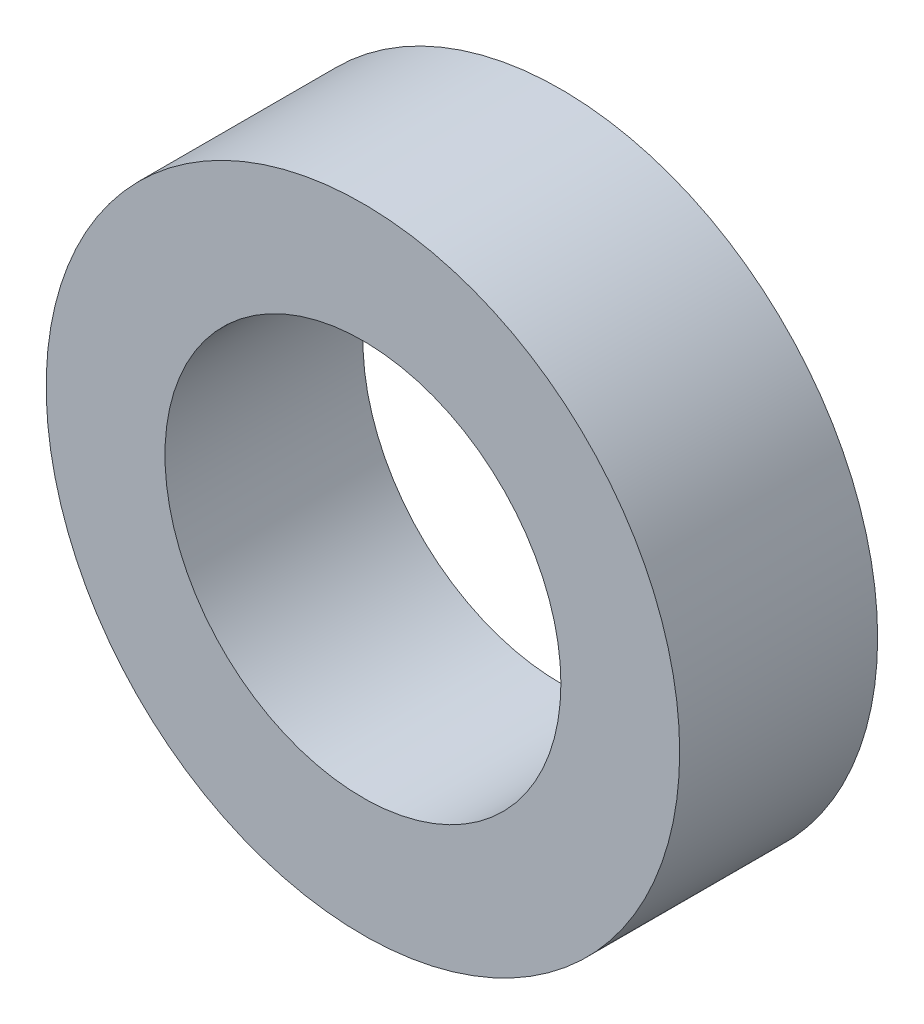
ISO-10303-21;
HEADER;
FILE_DESCRIPTION(('STEP AP214'),'2;1');
FILE_NAME('part.step','',(''),(''),'','','');
FILE_SCHEMA(('AUTOMOTIVE_DESIGN { 1 0 10303 214 1 1 1 1 }'));
ENDSEC;
DATA;
#1=APPLICATION_CONTEXT('core data for automotive mechanical design processes');
#2=APPLICATION_PROTOCOL_DEFINITION('international standard','automotive_design',2000,#1);
#3=PRODUCT_CONTEXT('',#1,'mechanical');
#4=PRODUCT('Part','Part','',(#3));
#5=PRODUCT_RELATED_PRODUCT_CATEGORY('part','',(#4));
#6=PRODUCT_DEFINITION_FORMATION('','',#4);
#7=PRODUCT_DEFINITION_CONTEXT('part definition',#1,'design');
#8=PRODUCT_DEFINITION('design','',#6,#7);
#9=PRODUCT_DEFINITION_SHAPE('','',#8);
#10=(LENGTH_UNIT() NAMED_UNIT(*) SI_UNIT(.MILLI.,.METRE.));
#11=(NAMED_UNIT(*) PLANE_ANGLE_UNIT() SI_UNIT($,.RADIAN.));
#12=(NAMED_UNIT(*) SI_UNIT($,.STERADIAN.) SOLID_ANGLE_UNIT());
#13=UNCERTAINTY_MEASURE_WITH_UNIT(LENGTH_MEASURE(1.E-05),#10,'distance_accuracy_value','');
#14=(GEOMETRIC_REPRESENTATION_CONTEXT(3) GLOBAL_UNCERTAINTY_ASSIGNED_CONTEXT((#13)) GLOBAL_UNIT_ASSIGNED_CONTEXT((#10,
#11,#12)) REPRESENTATION_CONTEXT('',''));
#15=CARTESIAN_POINT('',(0.,0.,0.));
#16=DIRECTION('',(0.,0.,1.));
#17=DIRECTION('',(1.,0.,0.));
#18=AXIS2_PLACEMENT_3D('',#15,#16,#17);
#19=CARTESIAN_POINT('',(0.,0.,2.5));
#20=DIRECTION('',(0.,0.,1.));
#21=DIRECTION('',(1.,0.,0.));
#22=AXIS2_PLACEMENT_3D('',#19,#20,#21);
#23=PLANE('',#22);
#24=CARTESIAN_POINT('',(0.,0.,2.5));
#25=DIRECTION('',(0.,0.,1.));
#26=DIRECTION('',(1.,0.,0.));
#27=AXIS2_PLACEMENT_3D('',#24,#25,#26);
#28=CIRCLE('',#27,4.);
#29=CARTESIAN_POINT('',(4.,0.,2.5));
#30=VERTEX_POINT('',#29);
#31=EDGE_CURVE('E10',#30,#30,#28,.T.);
#32=ORIENTED_EDGE('',*,*,#31,.T.);
#33=EDGE_LOOP('',(#32));
#34=FACE_BOUND('',#33,.T.);
#35=CARTESIAN_POINT('',(0.,0.,2.5));
#36=DIRECTION('',(0.,0.,1.));
#37=DIRECTION('',(1.,0.,0.));
#38=AXIS2_PLACEMENT_3D('',#35,#36,#37);
#39=CIRCLE('',#38,2.5);
#40=CARTESIAN_POINT('',(2.5,0.,2.5));
#41=VERTEX_POINT('',#40);
#42=EDGE_CURVE('E48',#41,#41,#39,.T.);
#43=ORIENTED_EDGE('',*,*,#42,.F.);
#44=EDGE_LOOP('',(#43));
#45=FACE_BOUND('',#44,.T.);
#46=ADVANCED_FACE('F34',(#34,#45),#23,.T.);
#47=CARTESIAN_POINT('',(0.,0.,0.));
#48=DIRECTION('',(0.,0.,1.));
#49=DIRECTION('',(1.,0.,0.));
#50=AXIS2_PLACEMENT_3D('',#47,#48,#49);
#51=PLANE('',#50);
#52=CARTESIAN_POINT('',(0.,0.,0.));
#53=DIRECTION('',(0.,0.,1.));
#54=DIRECTION('',(1.,0.,0.));
#55=AXIS2_PLACEMENT_3D('',#52,#53,#54);
#56=CIRCLE('',#55,4.);
#57=CARTESIAN_POINT('',(4.,0.,0.));
#58=VERTEX_POINT('',#57);
#59=EDGE_CURVE('E38',#58,#58,#56,.T.);
#60=ORIENTED_EDGE('',*,*,#59,.F.);
#61=EDGE_LOOP('',(#60));
#62=FACE_BOUND('',#61,.T.);
#63=CARTESIAN_POINT('',(0.,0.,0.));
#64=DIRECTION('',(0.,0.,1.));
#65=DIRECTION('',(1.,0.,0.));
#66=AXIS2_PLACEMENT_3D('',#63,#64,#65);
#67=CIRCLE('',#66,2.5);
#68=CARTESIAN_POINT('',(2.5,0.,0.));
#69=VERTEX_POINT('',#68);
#70=EDGE_CURVE('E50',#69,#69,#67,.T.);
#71=ORIENTED_EDGE('',*,*,#70,.T.);
#72=EDGE_LOOP('',(#71));
#73=FACE_BOUND('',#72,.T.);
#74=ADVANCED_FACE('F63',(#62,#73),#51,.F.);
#75=CARTESIAN_POINT('',(0.,0.,2.5));
#76=DIRECTION('',(0.,0.,-1.));
#77=DIRECTION('',(-1.,0.,0.));
#78=AXIS2_PLACEMENT_3D('',#75,#76,#77);
#79=CYLINDRICAL_SURFACE('',#78,4.);
#80=ORIENTED_EDGE('',*,*,#31,.F.);
#81=EDGE_LOOP('',(#80));
#82=FACE_BOUND('',#81,.T.);
#83=ORIENTED_EDGE('',*,*,#59,.T.);
#84=EDGE_LOOP('',(#83));
#85=FACE_BOUND('',#84,.T.);
#86=ADVANCED_FACE('F36',(#82,#85),#79,.T.);
#87=CARTESIAN_POINT('',(0.,0.,2.5));
#88=DIRECTION('',(0.,0.,-1.));
#89=DIRECTION('',(-1.,0.,0.));
#90=AXIS2_PLACEMENT_3D('',#87,#88,#89);
#91=CYLINDRICAL_SURFACE('',#90,2.5);
#92=ORIENTED_EDGE('',*,*,#42,.T.);
#93=EDGE_LOOP('',(#92));
#94=FACE_BOUND('',#93,.T.);
#95=ORIENTED_EDGE('',*,*,#70,.F.);
#96=EDGE_LOOP('',(#95));
#97=FACE_BOUND('',#96,.T.);
#98=ADVANCED_FACE('F59',(#94,#97),#91,.F.);
#99=CLOSED_SHELL('',(#46,#74,#86,#98));
#100=MANIFOLD_SOLID_BREP('B2',#99);
#101=ADVANCED_BREP_SHAPE_REPRESENTATION('',(#18,#100),#14);
#102=SHAPE_DEFINITION_REPRESENTATION(#9,#101);
ENDSEC;
END-ISO-10303-21;
